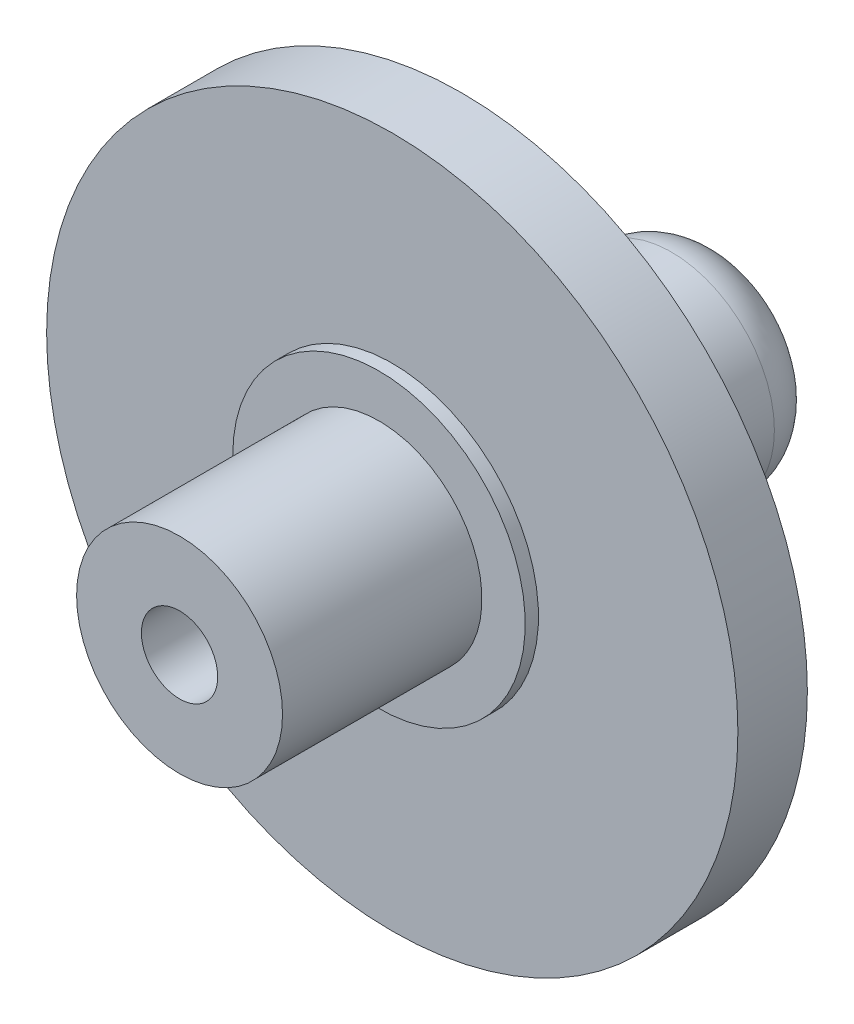
ISO-10303-21;
HEADER;
FILE_DESCRIPTION(('STEP AP214'),'2;1');
FILE_NAME('part.step','',(''),(''),'','','');
FILE_SCHEMA(('AUTOMOTIVE_DESIGN { 1 0 10303 214 1 1 1 1 }'));
ENDSEC;
DATA;
#1=APPLICATION_CONTEXT('core data for automotive mechanical design processes');
#2=APPLICATION_PROTOCOL_DEFINITION('international standard','automotive_design',2000,#1);
#3=PRODUCT_CONTEXT('',#1,'mechanical');
#4=PRODUCT('Part','Part','',(#3));
#5=PRODUCT_RELATED_PRODUCT_CATEGORY('part','',(#4));
#6=PRODUCT_DEFINITION_FORMATION('','',#4);
#7=PRODUCT_DEFINITION_CONTEXT('part definition',#1,'design');
#8=PRODUCT_DEFINITION('design','',#6,#7);
#9=PRODUCT_DEFINITION_SHAPE('','',#8);
#10=(LENGTH_UNIT() NAMED_UNIT(*) SI_UNIT(.MILLI.,.METRE.));
#11=(NAMED_UNIT(*) PLANE_ANGLE_UNIT() SI_UNIT($,.RADIAN.));
#12=(NAMED_UNIT(*) SI_UNIT($,.STERADIAN.) SOLID_ANGLE_UNIT());
#13=UNCERTAINTY_MEASURE_WITH_UNIT(LENGTH_MEASURE(1.E-05),#10,'distance_accuracy_value','');
#14=(GEOMETRIC_REPRESENTATION_CONTEXT(3) GLOBAL_UNCERTAINTY_ASSIGNED_CONTEXT((#13)) GLOBAL_UNIT_ASSIGNED_CONTEXT((#10,
#11,#12)) REPRESENTATION_CONTEXT('',''));
#15=CARTESIAN_POINT('',(0.,0.,0.));
#16=DIRECTION('',(0.,0.,1.));
#17=DIRECTION('',(1.,0.,0.));
#18=AXIS2_PLACEMENT_3D('',#15,#16,#17);
#19=CARTESIAN_POINT('',(40.399999972,-23.75,-17.9544982541421));
#20=DIRECTION('',(0.,0.,1.));
#21=DIRECTION('',(1.,0.,0.));
#22=AXIS2_PLACEMENT_3D('',#19,#20,#21);
#23=CYLINDRICAL_SURFACE('',#22,3.873);
#24=CARTESIAN_POINT('',(40.399999972,-23.75,-4.99999993600007));
#25=DIRECTION('',(0.,0.,1.));
#26=DIRECTION('',(1.,0.,0.));
#27=AXIS2_PLACEMENT_3D('',#24,#25,#26);
#28=CIRCLE('',#27,3.873);
#29=CARTESIAN_POINT('',(44.2729999720001,-23.75,-4.99999993600007));
#30=VERTEX_POINT('',#29);
#31=EDGE_CURVE('E49',#30,#30,#28,.T.);
#32=ORIENTED_EDGE('',*,*,#31,.T.);
#33=EDGE_LOOP('',(#32));
#34=FACE_BOUND('',#33,.T.);
#35=CARTESIAN_POINT('',(40.399999972,-23.75,0.));
#36=DIRECTION('',(0.,0.,1.));
#37=DIRECTION('',(1.,0.,0.));
#38=AXIS2_PLACEMENT_3D('',#35,#36,#37);
#39=CIRCLE('',#38,3.873);
#40=CARTESIAN_POINT('',(44.2729999720001,-23.75,0.));
#41=VERTEX_POINT('',#40);
#42=EDGE_CURVE('E57',#41,#41,#39,.T.);
#43=ORIENTED_EDGE('',*,*,#42,.F.);
#44=EDGE_LOOP('',(#43));
#45=FACE_BOUND('',#44,.T.);
#46=ADVANCED_FACE('F34',(#34,#45),#23,.T.);
#47=CARTESIAN_POINT('',(153.178854405814,0.,-7.00000000000008));
#48=DIRECTION('',(0.,0.,1.));
#49=DIRECTION('',(0.,-1.,0.));
#50=AXIS2_PLACEMENT_3D('',#47,#48,#49);
#51=PLANE('',#50);
#52=CARTESIAN_POINT('',(40.399999972,-23.75,-7.00000000000007));
#53=DIRECTION('',(0.,0.,1.));
#54=DIRECTION('',(1.,0.,0.));
#55=AXIS2_PLACEMENT_3D('',#52,#53,#54);
#56=CIRCLE('',#55,1.43499999999999);
#57=CARTESIAN_POINT('',(41.834999972,-23.75,-7.00000000000007));
#58=VERTEX_POINT('',#57);
#59=EDGE_CURVE('E75',#58,#58,#56,.T.);
#60=ORIENTED_EDGE('',*,*,#59,.T.);
#61=EDGE_LOOP('',(#60));
#62=FACE_BOUND('',#61,.T.);
#63=CARTESIAN_POINT('',(40.399999972,-23.75,-7.00000000000007));
#64=DIRECTION('',(0.,0.,1.));
#65=DIRECTION('',(1.,0.,0.));
#66=AXIS2_PLACEMENT_3D('',#63,#64,#65);
#67=CIRCLE('',#66,1.872999936);
#68=CARTESIAN_POINT('',(42.272999908,-23.75,-7.00000000000007));
#69=VERTEX_POINT('',#68);
#70=EDGE_CURVE('E54',#69,#69,#67,.F.);
#71=ORIENTED_EDGE('',*,*,#70,.T.);
#72=EDGE_LOOP('',(#71));
#73=FACE_BOUND('',#72,.T.);
#74=ADVANCED_FACE('F79',(#62,#73),#51,.F.);
#75=CARTESIAN_POINT('',(40.399999972,-23.75,-4.99999993600007));
#76=DIRECTION('',(0.,0.,1.));
#77=DIRECTION('',(1.,0.,0.));
#78=AXIS2_PLACEMENT_3D('',#75,#76,#77);
#79=DEGENERATE_TOROIDAL_SURFACE('',#78,1.872999936,2.000000064,.T.);
#80=ORIENTED_EDGE('',*,*,#31,.F.);
#81=EDGE_LOOP('',(#80));
#82=FACE_BOUND('',#81,.T.);
#83=ORIENTED_EDGE('',*,*,#70,.F.);
#84=EDGE_LOOP('',(#83));
#85=FACE_BOUND('',#84,.T.);
#86=ADVANCED_FACE('F106',(#82,#85),#79,.T.);
#87=CARTESIAN_POINT('',(0.,0.,0.));
#88=DIRECTION('',(0.,0.,1.));
#89=DIRECTION('',(1.,0.,0.));
#90=AXIS2_PLACEMENT_3D('',#87,#88,#89);
#91=PLANE('',#90);
#92=ORIENTED_EDGE('',*,*,#42,.T.);
#93=EDGE_LOOP('',(#92));
#94=FACE_BOUND('',#93,.T.);
#95=CARTESIAN_POINT('',(40.399999972,-23.75,0.));
#96=DIRECTION('',(0.,0.,1.));
#97=DIRECTION('',(1.,0.,0.));
#98=AXIS2_PLACEMENT_3D('',#95,#96,#97);
#99=CIRCLE('',#98,7.99999999999998);
#100=CARTESIAN_POINT('',(48.399999972,-23.75,0.));
#101=VERTEX_POINT('',#100);
#102=EDGE_CURVE('E60',#101,#101,#99,.T.);
#103=ORIENTED_EDGE('',*,*,#102,.F.);
#104=EDGE_LOOP('',(#103));
#105=FACE_BOUND('',#104,.T.);
#106=ADVANCED_FACE('F111',(#94,#105),#91,.F.);
#107=CARTESIAN_POINT('',(40.399999972,-23.75,42.7695526217006));
#108=DIRECTION('',(0.,0.,-1.));
#109=DIRECTION('',(-1.,0.,0.));
#110=AXIS2_PLACEMENT_3D('',#107,#108,#109);
#111=CYLINDRICAL_SURFACE('',#110,13.);
#112=CARTESIAN_POINT('',(40.399999972,-23.75,2.88675134594807));
#113=DIRECTION('',(0.,0.,1.));
#114=DIRECTION('',(1.,0.,0.));
#115=AXIS2_PLACEMENT_3D('',#112,#113,#114);
#116=CIRCLE('',#115,13.);
#117=CARTESIAN_POINT('',(53.399999972,-23.75,2.88675134594807));
#118=VERTEX_POINT('',#117);
#119=EDGE_CURVE('E45',#118,#118,#116,.T.);
#120=ORIENTED_EDGE('',*,*,#119,.T.);
#121=EDGE_LOOP('',(#120));
#122=FACE_BOUND('',#121,.T.);
#123=CARTESIAN_POINT('',(40.399999972,-23.75,5.50000000000014));
#124=DIRECTION('',(0.,0.,-1.));
#125=DIRECTION('',(-1.,0.,0.));
#126=AXIS2_PLACEMENT_3D('',#123,#124,#125);
#127=CIRCLE('',#126,13.);
#128=CARTESIAN_POINT('',(27.399999972,-23.75,5.50000000000012));
#129=VERTEX_POINT('',#128);
#130=EDGE_CURVE('E63',#129,#129,#127,.T.);
#131=ORIENTED_EDGE('',*,*,#130,.T.);
#132=EDGE_LOOP('',(#131));
#133=FACE_BOUND('',#132,.T.);
#134=ADVANCED_FACE('F116',(#122,#133),#111,.T.);
#135=CARTESIAN_POINT('',(40.3999999719993,-23.7500000000067,5.50000000000014));
#136=DIRECTION('',(0.,0.,-1.));
#137=DIRECTION('',(-0.673752072390309,0.738957471678691,0.));
#138=AXIS2_PLACEMENT_3D('',#135,#136,#137);
#139=PLANE('',#138);
#140=CARTESIAN_POINT('',(40.399999972,-23.75,5.50000000000014));
#141=DIRECTION('',(0.,0.,-1.));
#142=DIRECTION('',(-1.,0.,0.));
#143=AXIS2_PLACEMENT_3D('',#140,#141,#142);
#144=CIRCLE('',#143,5.49999999999998);
#145=CARTESIAN_POINT('',(34.8999999720001,-23.75,5.50000000000013));
#146=VERTEX_POINT('',#145);
#147=EDGE_CURVE('E11',#146,#146,#144,.F.);
#148=ORIENTED_EDGE('',*,*,#147,.F.);
#149=EDGE_LOOP('',(#148));
#150=FACE_BOUND('',#149,.T.);
#151=ORIENTED_EDGE('',*,*,#130,.F.);
#152=EDGE_LOOP('',(#151));
#153=FACE_BOUND('',#152,.T.);
#154=ADVANCED_FACE('F124',(#150,#153),#139,.F.);
#155=CARTESIAN_POINT('',(40.399999972,-23.75,3.));
#156=DIRECTION('',(0.,0.,1.));
#157=DIRECTION('',(1.,0.,0.));
#158=AXIS2_PLACEMENT_3D('',#155,#156,#157);
#159=CONICAL_SURFACE('',#158,13.1961524227067,1.0471975511966);
#160=ORIENTED_EDGE('',*,*,#102,.T.);
#161=EDGE_LOOP('',(#160));
#162=FACE_BOUND('',#161,.T.);
#163=ORIENTED_EDGE('',*,*,#119,.F.);
#164=EDGE_LOOP('',(#163));
#165=FACE_BOUND('',#164,.T.);
#166=ADVANCED_FACE('F36',(#162,#165),#159,.T.);
#167=CARTESIAN_POINT('',(40.399999972,-23.75,21.5563491861041));
#168=DIRECTION('',(0.,0.,-1.));
#169=DIRECTION('',(-1.,0.,0.));
#170=AXIS2_PLACEMENT_3D('',#167,#168,#169);
#171=CYLINDRICAL_SURFACE('',#170,5.49999999999998);
#172=CARTESIAN_POINT('',(40.399999972,-23.75,6.00000000000014));
#173=DIRECTION('',(0.,0.,-1.));
#174=DIRECTION('',(-1.,0.,0.));
#175=AXIS2_PLACEMENT_3D('',#172,#173,#174);
#176=CIRCLE('',#175,5.49999999999998);
#177=CARTESIAN_POINT('',(34.8999999720001,-23.75,6.00000000000013));
#178=VERTEX_POINT('',#177);
#179=EDGE_CURVE('E72',#178,#178,#176,.T.);
#180=ORIENTED_EDGE('',*,*,#179,.T.);
#181=EDGE_LOOP('',(#180));
#182=FACE_BOUND('',#181,.T.);
#183=ORIENTED_EDGE('',*,*,#147,.T.);
#184=EDGE_LOOP('',(#183));
#185=FACE_BOUND('',#184,.T.);
#186=ADVANCED_FACE('F95',(#182,#185),#171,.T.);
#187=CARTESIAN_POINT('',(40.3999999719993,-23.7500000000067,6.00000000000014));
#188=DIRECTION('',(0.,0.,-1.));
#189=DIRECTION('',(-0.673752072390309,0.738957471678691,0.));
#190=AXIS2_PLACEMENT_3D('',#187,#188,#189);
#191=PLANE('',#190);
#192=CARTESIAN_POINT('',(40.399999972,-23.75,6.00000000000014));
#193=DIRECTION('',(0.,0.,-1.));
#194=DIRECTION('',(-1.,0.,0.));
#195=AXIS2_PLACEMENT_3D('',#192,#193,#194);
#196=CIRCLE('',#195,3.87299999999998);
#197=CARTESIAN_POINT('',(36.5269999720001,-23.75,6.00000000000013));
#198=VERTEX_POINT('',#197);
#199=EDGE_CURVE('E41',#198,#198,#196,.T.);
#200=ORIENTED_EDGE('',*,*,#199,.T.);
#201=EDGE_LOOP('',(#200));
#202=FACE_BOUND('',#201,.T.);
#203=ORIENTED_EDGE('',*,*,#179,.F.);
#204=EDGE_LOOP('',(#203));
#205=FACE_BOUND('',#204,.T.);
#206=ADVANCED_FACE('F85',(#202,#205),#191,.F.);
#207=CARTESIAN_POINT('',(40.399999972,-23.75,24.4544982541418));
#208=DIRECTION('',(0.,0.,-1.));
#209=DIRECTION('',(-1.,0.,0.));
#210=AXIS2_PLACEMENT_3D('',#207,#208,#209);
#211=CYLINDRICAL_SURFACE('',#210,1.43499999999999);
#212=CARTESIAN_POINT('',(40.3999999720001,-23.75,13.4999999999999));
#213=DIRECTION('',(0.,0.,-1.));
#214=DIRECTION('',(-1.,0.,0.));
#215=AXIS2_PLACEMENT_3D('',#212,#213,#214);
#216=CIRCLE('',#215,1.43499999999999);
#217=CARTESIAN_POINT('',(38.9649999720001,-23.75,13.4999999999999));
#218=VERTEX_POINT('',#217);
#219=EDGE_CURVE('E69',#218,#218,#216,.T.);
#220=ORIENTED_EDGE('',*,*,#219,.F.);
#221=EDGE_LOOP('',(#220));
#222=FACE_BOUND('',#221,.T.);
#223=ORIENTED_EDGE('',*,*,#59,.F.);
#224=EDGE_LOOP('',(#223));
#225=FACE_BOUND('',#224,.T.);
#226=ADVANCED_FACE('F82',(#222,#225),#211,.F.);
#227=CARTESIAN_POINT('',(0.,0.,13.4999999999999));
#228=DIRECTION('',(0.,0.,1.));
#229=DIRECTION('',(1.,0.,0.));
#230=AXIS2_PLACEMENT_3D('',#227,#228,#229);
#231=PLANE('',#230);
#232=ORIENTED_EDGE('',*,*,#219,.T.);
#233=EDGE_LOOP('',(#232));
#234=FACE_BOUND('',#233,.T.);
#235=CARTESIAN_POINT('',(40.399999972,-23.75,13.4999999999999));
#236=DIRECTION('',(0.,0.,1.));
#237=DIRECTION('',(1.,0.,0.));
#238=AXIS2_PLACEMENT_3D('',#235,#236,#237);
#239=CIRCLE('',#238,3.87299999999998);
#240=CARTESIAN_POINT('',(44.272999972,-23.75,13.4999999999999));
#241=VERTEX_POINT('',#240);
#242=EDGE_CURVE('E66',#241,#241,#239,.T.);
#243=ORIENTED_EDGE('',*,*,#242,.T.);
#244=EDGE_LOOP('',(#243));
#245=FACE_BOUND('',#244,.T.);
#246=ADVANCED_FACE('F84',(#234,#245),#231,.T.);
#247=CARTESIAN_POINT('',(40.399999972,-23.75,24.4544982541418));
#248=DIRECTION('',(0.,0.,-1.));
#249=DIRECTION('',(-1.,0.,0.));
#250=AXIS2_PLACEMENT_3D('',#247,#248,#249);
#251=CYLINDRICAL_SURFACE('',#250,3.87299999999998);
#252=ORIENTED_EDGE('',*,*,#242,.F.);
#253=EDGE_LOOP('',(#252));
#254=FACE_BOUND('',#253,.T.);
#255=ORIENTED_EDGE('',*,*,#199,.F.);
#256=EDGE_LOOP('',(#255));
#257=FACE_BOUND('',#256,.T.);
#258=ADVANCED_FACE('F92',(#254,#257),#251,.T.);
#259=CLOSED_SHELL('',(#46,#74,#86,#106,#134,#154,#166,#186,#206,#226,#246,#258));
#260=MANIFOLD_SOLID_BREP('B2',#259);
#261=ADVANCED_BREP_SHAPE_REPRESENTATION('',(#18,#260),#14);
#262=SHAPE_DEFINITION_REPRESENTATION(#9,#261);
ENDSEC;
END-ISO-10303-21;
